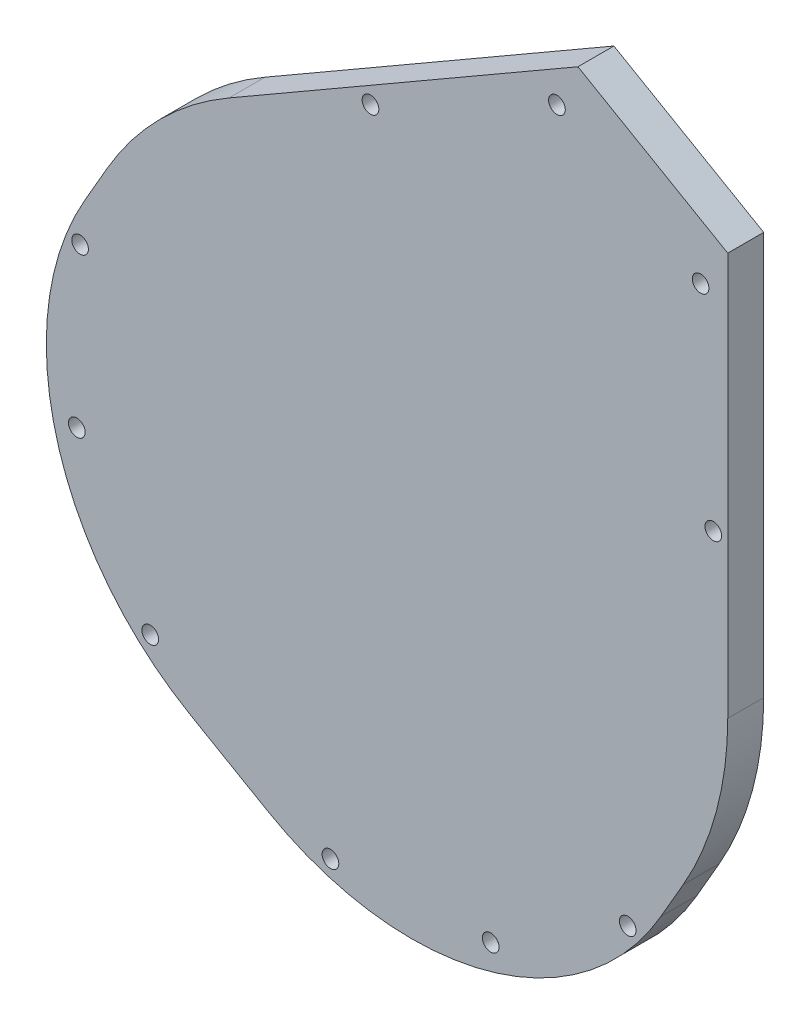
ISO-10303-21;
HEADER;
FILE_DESCRIPTION(('STEP AP214'),'2;1');
FILE_NAME('part.step','',(''),(''),'','','');
FILE_SCHEMA(('AUTOMOTIVE_DESIGN { 1 0 10303 214 1 1 1 1 }'));
ENDSEC;
DATA;
#1=APPLICATION_CONTEXT('core data for automotive mechanical design processes');
#2=APPLICATION_PROTOCOL_DEFINITION('international standard','automotive_design',2000,#1);
#3=PRODUCT_CONTEXT('',#1,'mechanical');
#4=PRODUCT('Part','Part','',(#3));
#5=PRODUCT_RELATED_PRODUCT_CATEGORY('part','',(#4));
#6=PRODUCT_DEFINITION_FORMATION('','',#4);
#7=PRODUCT_DEFINITION_CONTEXT('part definition',#1,'design');
#8=PRODUCT_DEFINITION('design','',#6,#7);
#9=PRODUCT_DEFINITION_SHAPE('','',#8);
#10=(LENGTH_UNIT() NAMED_UNIT(*) SI_UNIT(.MILLI.,.METRE.));
#11=(NAMED_UNIT(*) PLANE_ANGLE_UNIT() SI_UNIT($,.RADIAN.));
#12=(NAMED_UNIT(*) SI_UNIT($,.STERADIAN.) SOLID_ANGLE_UNIT());
#13=UNCERTAINTY_MEASURE_WITH_UNIT(LENGTH_MEASURE(1.E-05),#10,'distance_accuracy_value','');
#14=(GEOMETRIC_REPRESENTATION_CONTEXT(3) GLOBAL_UNCERTAINTY_ASSIGNED_CONTEXT((#13)) GLOBAL_UNIT_ASSIGNED_CONTEXT((#10,
#11,#12)) REPRESENTATION_CONTEXT('',''));
#15=CARTESIAN_POINT('',(0.,0.,0.));
#16=DIRECTION('',(0.,0.,1.));
#17=DIRECTION('',(1.,0.,0.));
#18=AXIS2_PLACEMENT_3D('',#15,#16,#17);
#19=CARTESIAN_POINT('',(0.103482409472565,1.99137052399343,0.));
#20=DIRECTION('',(0.,0.,1.));
#21=DIRECTION('',(1.,0.,0.));
#22=AXIS2_PLACEMENT_3D('',#19,#20,#21);
#23=PLANE('',#22);
#24=CARTESIAN_POINT('',(28.6674802089185,80.7675094713847,0.));
#25=DIRECTION('',(0.,0.,1.));
#26=DIRECTION('',(1.,0.,0.));
#27=AXIS2_PLACEMENT_3D('',#24,#25,#26);
#28=CIRCLE('',#27,1.4732);
#29=CARTESIAN_POINT('',(30.1406802089185,80.7675094713847,0.));
#30=VERTEX_POINT('',#29);
#31=EDGE_CURVE('E236',#30,#30,#28,.T.);
#32=ORIENTED_EDGE('',*,*,#31,.T.);
#33=EDGE_LOOP('',(#32));
#34=FACE_BOUND('',#33,.T.);
#35=CARTESIAN_POINT('',(54.0436210502447,66.1165877256513,0.));
#36=DIRECTION('',(0.,0.,1.));
#37=DIRECTION('',(1.,0.,0.));
#38=AXIS2_PLACEMENT_3D('',#35,#36,#37);
#39=CIRCLE('',#38,1.4732);
#40=CARTESIAN_POINT('',(55.5168210502447,66.1165877256513,0.));
#41=VERTEX_POINT('',#40);
#42=EDGE_CURVE('E242',#41,#41,#39,.T.);
#43=ORIENTED_EDGE('',*,*,#42,.T.);
#44=EDGE_LOOP('',(#43));
#45=FACE_BOUND('',#44,.T.);
#46=CARTESIAN_POINT('',(-4.27211491681913,64.3354611976759,0.));
#47=DIRECTION('',(0.,0.,1.));
#48=DIRECTION('',(1.,0.,0.));
#49=AXIS2_PLACEMENT_3D('',#46,#47,#48);
#50=CIRCLE('',#49,1.4732);
#51=CARTESIAN_POINT('',(-2.79891491681913,64.3354611976759,0.));
#52=VERTEX_POINT('',#51);
#53=EDGE_CURVE('E248',#52,#52,#50,.T.);
#54=ORIENTED_EDGE('',*,*,#53,.T.);
#55=EDGE_LOOP('',(#54));
#56=FACE_BOUND('',#55,.T.);
#57=CARTESIAN_POINT('',(-55.5710270998462,17.2749185589491,0.));
#58=DIRECTION('',(0.,0.,1.));
#59=DIRECTION('',(1.,0.,0.));
#60=AXIS2_PLACEMENT_3D('',#57,#58,#59);
#61=CIRCLE('',#60,1.4732);
#62=CARTESIAN_POINT('',(-54.0978270998462,17.2749185589491,0.));
#63=VERTEX_POINT('',#62);
#64=EDGE_CURVE('E254',#63,#63,#61,.T.);
#65=ORIENTED_EDGE('',*,*,#64,.T.);
#66=EDGE_LOOP('',(#65));
#67=FACE_BOUND('',#66,.T.);
#68=CARTESIAN_POINT('',(-56.1468961494133,-11.0137346898085,0.));
#69=DIRECTION('',(0.,0.,1.));
#70=DIRECTION('',(1.,0.,0.));
#71=AXIS2_PLACEMENT_3D('',#68,#69,#70);
#72=CIRCLE('',#71,1.4732);
#73=CARTESIAN_POINT('',(-54.6736961494133,-11.0137346898085,0.));
#74=VERTEX_POINT('',#73);
#75=EDGE_CURVE('E260',#74,#74,#72,.T.);
#76=ORIENTED_EDGE('',*,*,#75,.T.);
#77=EDGE_LOOP('',(#76));
#78=FACE_BOUND('',#77,.T.);
#79=CARTESIAN_POINT('',(-43.1786676791821,-36.2171800025993,0.));
#80=DIRECTION('',(0.,0.,1.));
#81=DIRECTION('',(1.,0.,0.));
#82=AXIS2_PLACEMENT_3D('',#79,#80,#81);
#83=CIRCLE('',#82,1.4732);
#84=CARTESIAN_POINT('',(-41.7054676791821,-36.2171800025993,0.));
#85=VERTEX_POINT('',#84);
#86=EDGE_CURVE('E266',#85,#85,#83,.T.);
#87=ORIENTED_EDGE('',*,*,#86,.T.);
#88=EDGE_LOOP('',(#87));
#89=FACE_BOUND('',#88,.T.);
#90=CARTESIAN_POINT('',(-11.3450179440084,-54.59634624649,0.));
#91=DIRECTION('',(0.,0.,1.));
#92=DIRECTION('',(1.,0.,0.));
#93=AXIS2_PLACEMENT_3D('',#90,#91,#92);
#94=CIRCLE('',#93,1.4732);
#95=CARTESIAN_POINT('',(-9.87181794400842,-54.59634624649,0.));
#96=VERTEX_POINT('',#95);
#97=EDGE_CURVE('E272',#96,#96,#94,.T.);
#98=ORIENTED_EDGE('',*,*,#97,.T.);
#99=EDGE_LOOP('',(#98));
#100=FACE_BOUND('',#99,.T.);
#101=CARTESIAN_POINT('',(16.9659201948758,-53.2254388873952,0.));
#102=DIRECTION('',(0.,0.,1.));
#103=DIRECTION('',(1.,0.,0.));
#104=AXIS2_PLACEMENT_3D('',#101,#102,#103);
#105=CIRCLE('',#104,1.4732);
#106=CARTESIAN_POINT('',(18.4391201948758,-53.2254388873952,0.));
#107=VERTEX_POINT('',#106);
#108=EDGE_CURVE('E278',#107,#107,#105,.T.);
#109=ORIENTED_EDGE('',*,*,#108,.T.);
#110=EDGE_LOOP('',(#109));
#111=FACE_BOUND('',#110,.T.);
#112=CARTESIAN_POINT('',(41.1766780223654,-38.582395036838,0.));
#113=DIRECTION('',(0.,0.,1.));
#114=DIRECTION('',(1.,0.,0.));
#115=AXIS2_PLACEMENT_3D('',#112,#113,#114);
#116=CIRCLE('',#115,1.4732);
#117=CARTESIAN_POINT('',(42.6498780223654,-38.582395036838,0.));
#118=VERTEX_POINT('',#117);
#119=EDGE_CURVE('E284',#118,#118,#116,.T.);
#120=ORIENTED_EDGE('',*,*,#119,.T.);
#121=EDGE_LOOP('',(#120));
#122=FACE_BOUND('',#121,.T.);
#123=CARTESIAN_POINT('',(56.2828473718697,29.374037419534,0.));
#124=DIRECTION('',(0.,0.,1.));
#125=DIRECTION('',(1.,0.,0.));
#126=AXIS2_PLACEMENT_3D('',#123,#124,#125);
#127=CIRCLE('',#126,1.4732);
#128=CARTESIAN_POINT('',(57.7560473718697,29.374037419534,0.));
#129=VERTEX_POINT('',#128);
#130=EDGE_CURVE('E290',#129,#129,#127,.T.);
#131=ORIENTED_EDGE('',*,*,#130,.T.);
#132=EDGE_LOOP('',(#131));
#133=FACE_BOUND('',#132,.T.);
#134=DIRECTION('',(0.86602540378444,-0.499999999999998,0.));
#135=VECTOR('',#134,1.);
#136=CARTESIAN_POINT('',(-80.1334347453141,-19.508046630794,0.));
#137=LINE('',#136,#135);
#138=CARTESIAN_POINT('',(-36.1393442330646,-44.9080466307939,0.));
#139=VERTEX_POINT('',#138);
#140=CARTESIAN_POINT('',(-22.3911909479873,-52.8455466307935,0.));
#141=VERTEX_POINT('',#140);
#142=EDGE_CURVE('E321',#139,#141,#137,.T.);
#143=ORIENTED_EDGE('',*,*,#142,.F.);
#144=CARTESIAN_POINT('',(-10.7393442330648,-0.913956118544348,0.));
#145=DIRECTION('',(0.,0.,1.));
#146=DIRECTION('',(1.,0.,0.));
#147=AXIS2_PLACEMENT_3D('',#144,#145,#146);
#148=CIRCLE('',#147,50.8);
#149=CARTESIAN_POINT('',(-54.7334347453143,24.4860438814555,0.));
#150=VERTEX_POINT('',#149);
#151=EDGE_CURVE('E353',#139,#150,#148,.F.);
#152=ORIENTED_EDGE('',*,*,#151,.T.);
#153=DIRECTION('',(-0.499999999999997,-0.86602540378444,0.));
#154=VECTOR('',#153,1.);
#155=CARTESIAN_POINT('',(-80.1334347453141,-19.508046630794,0.));
#156=LINE('',#155,#154);
#157=CARTESIAN_POINT('',(-50.7646847453143,31.3601205239945,0.));
#158=VERTEX_POINT('',#157);
#159=EDGE_CURVE('E319',#158,#150,#156,.T.);
#160=ORIENTED_EDGE('',*,*,#159,.F.);
#161=CARTESIAN_POINT('',(0.103482409472565,1.99137052399343,0.));
#162=DIRECTION('',(0.,0.,1.));
#163=DIRECTION('',(-1.,0.,0.));
#164=AXIS2_PLACEMENT_3D('',#161,#162,#163);
#165=CIRCLE('',#164,58.7374999999992);
#166=CARTESIAN_POINT('',(-29.2652675905272,52.8595376787811,0.));
#167=VERTEX_POINT('',#166);
#168=EDGE_CURVE('E317',#167,#158,#165,.T.);
#169=ORIENTED_EDGE('',*,*,#168,.F.);
#170=DIRECTION('',(-0.866025403784443,-0.499999999999992,0.));
#171=VECTOR('',#170,1.);
#172=CARTESIAN_POINT('',(32.3771517353856,88.4488050700959,0.));
#173=LINE('',#172,#171);
#174=CARTESIAN_POINT('',(32.3771517353856,88.4488050700959,0.));
#175=VERTEX_POINT('',#174);
#176=EDGE_CURVE('E315',#175,#167,#173,.T.);
#177=ORIENTED_EDGE('',*,*,#176,.F.);
#178=DIRECTION('',(-0.86602540378444,0.499999999999998,0.));
#179=VECTOR('',#178,1.);
#180=CARTESIAN_POINT('',(32.3771517353856,88.4488050700959,0.));
#181=LINE('',#180,#179);
#182=CARTESIAN_POINT('',(58.8409824094726,73.1699053066232,0.));
#183=VERTEX_POINT('',#182);
#184=EDGE_CURVE('E293',#183,#175,#181,.T.);
#185=ORIENTED_EDGE('',*,*,#184,.F.);
#186=DIRECTION('',(0.,1.,0.));
#187=VECTOR('',#186,1.);
#188=CARTESIAN_POINT('',(58.8409824094726,1.99137052399343,0.));
#189=LINE('',#188,#187);
#190=CARTESIAN_POINT('',(58.8409824094726,1.99137052399343,0.));
#191=VERTEX_POINT('',#190);
#192=EDGE_CURVE('E298',#191,#183,#189,.T.);
#193=ORIENTED_EDGE('',*,*,#192,.F.);
#194=CARTESIAN_POINT('',(0.103482409472565,1.99137052399343,0.));
#195=DIRECTION('',(0.,0.,1.));
#196=DIRECTION('',(1.,0.,0.));
#197=AXIS2_PLACEMENT_3D('',#194,#195,#196);
#198=CIRCLE('',#197,58.7375);
#199=CARTESIAN_POINT('',(50.9716495642611,-27.3773794760064,0.));
#200=VERTEX_POINT('',#199);
#201=EDGE_CURVE('E326',#200,#191,#198,.T.);
#202=ORIENTED_EDGE('',*,*,#201,.F.);
#203=DIRECTION('',(0.499999999999998,0.86602540378444,0.));
#204=VECTOR('',#203,1.);
#205=CARTESIAN_POINT('',(21.6028995642622,-78.2455466307933,0.));
#206=LINE('',#205,#204);
#207=CARTESIAN_POINT('',(47.0028995642621,-34.2514561185438,0.));
#208=VERTEX_POINT('',#207);
#209=EDGE_CURVE('E324',#208,#200,#206,.T.);
#210=ORIENTED_EDGE('',*,*,#209,.F.);
#211=CARTESIAN_POINT('',(3.00880905201254,-8.85145611854391,0.));
#212=DIRECTION('',(0.,0.,1.));
#213=DIRECTION('',(1.,0.,0.));
#214=AXIS2_PLACEMENT_3D('',#211,#212,#213);
#215=CIRCLE('',#214,50.8);
#216=EDGE_CURVE('E351',#208,#141,#215,.F.);
#217=ORIENTED_EDGE('',*,*,#216,.T.);
#218=EDGE_LOOP('',(#143,#152,#160,#169,#177,#185,#193,#202,#210,#217));
#219=FACE_BOUND('',#218,.T.);
#220=CARTESIAN_POINT('',(0.103482409472572,1.99137052399344,0.));
#221=DIRECTION('',(0.,0.,1.));
#222=DIRECTION('',(1.,0.,0.));
#223=AXIS2_PLACEMENT_3D('',#220,#221,#222);
#224=CIRCLE('',#223,55.7657000000002);
#225=CARTESIAN_POINT('',(-24.935414966253,51.8197451181732,0.));
#226=VERTEX_POINT('',#225);
#227=CARTESIAN_POINT('',(55.7755693251752,5.22123661107405,0.));
#228=VERTEX_POINT('',#227);
#229=EDGE_CURVE('E180',#226,#228,#224,.T.);
#230=ORIENTED_EDGE('',*,*,#229,.T.);
#231=DIRECTION('',(-0.06053758958794,0.998165918195408,0.));
#232=VECTOR('',#231,1.);
#233=CARTESIAN_POINT('',(55.7755693251752,5.22123661107405,0.));
#234=LINE('',#233,#232);
#235=CARTESIAN_POINT('',(52.1129608347412,65.6116649668911,0.));
#236=VERTEX_POINT('',#235);
#237=EDGE_CURVE('E216',#228,#236,#234,.T.);
#238=ORIENTED_EDGE('',*,*,#237,.T.);
#239=CARTESIAN_POINT('',(36.0840670724291,64.311571246266,0.));
#240=DIRECTION('',(0.,0.,1.));
#241=DIRECTION('',(1.,0.,0.));
#242=AXIS2_PLACEMENT_3D('',#239,#240,#241);
#243=CIRCLE('',#242,16.081532231908);
#244=CARTESIAN_POINT('',(29.1955343806349,78.8430472993028,0.));
#245=VERTEX_POINT('',#244);
#246=EDGE_CURVE('E219',#236,#245,#243,.T.);
#247=ORIENTED_EDGE('',*,*,#246,.T.);
#248=DIRECTION('',(-0.89470583714302,-0.446655868630658,0.));
#249=VECTOR('',#248,1.);
#250=CARTESIAN_POINT('',(29.1955343806349,78.8430472993028,0.));
#251=LINE('',#250,#249);
#252=EDGE_CURVE('E207',#245,#226,#251,.T.);
#253=ORIENTED_EDGE('',*,*,#252,.T.);
#254=EDGE_LOOP('',(#230,#238,#247,#253));
#255=FACE_BOUND('',#254,.T.);
#256=ADVANCED_FACE('F32',(#34,#45,#56,#67,#78,#89,#100,#111,#122,#133,#219,#255),#23,.F.);
#257=CARTESIAN_POINT('',(32.3771517353856,88.4488050700959,6.35));
#258=DIRECTION('',(-0.499999999999998,-0.86602540378444,0.));
#259=DIRECTION('',(0.86602540378444,-0.499999999999998,0.));
#260=AXIS2_PLACEMENT_3D('',#257,#258,#259);
#261=PLANE('',#260);
#262=ORIENTED_EDGE('',*,*,#184,.T.);
#263=DIRECTION('',(0.,0.,-1.));
#264=VECTOR('',#263,1.);
#265=CARTESIAN_POINT('',(32.3771517353856,88.4488050700959,6.35));
#266=LINE('',#265,#264);
#267=CARTESIAN_POINT('',(32.3771517353856,88.4488050700959,6.35));
#268=VERTEX_POINT('',#267);
#269=EDGE_CURVE('E343',#268,#175,#266,.T.);
#270=ORIENTED_EDGE('',*,*,#269,.F.);
#271=DIRECTION('',(-0.86602540378444,0.499999999999998,0.));
#272=VECTOR('',#271,1.);
#273=CARTESIAN_POINT('',(32.3771517353856,88.4488050700959,6.35));
#274=LINE('',#273,#272);
#275=CARTESIAN_POINT('',(58.8409824094726,73.1699053066232,6.35));
#276=VERTEX_POINT('',#275);
#277=EDGE_CURVE('E294',#276,#268,#274,.T.);
#278=ORIENTED_EDGE('',*,*,#277,.F.);
#279=DIRECTION('',(0.,0.,-1.));
#280=VECTOR('',#279,1.);
#281=CARTESIAN_POINT('',(58.8409824094726,73.1699053066232,6.35));
#282=LINE('',#281,#280);
#283=EDGE_CURVE('E312',#276,#183,#282,.T.);
#284=ORIENTED_EDGE('',*,*,#283,.T.);
#285=EDGE_LOOP('',(#262,#270,#278,#284));
#286=FACE_BOUND('',#285,.T.);
#287=ADVANCED_FACE('F383',(#286),#261,.F.);
#288=CARTESIAN_POINT('',(32.3771517353856,88.4488050700959,6.35));
#289=DIRECTION('',(0.499999999999992,-0.866025403784443,0.));
#290=DIRECTION('',(0.866025403784443,0.499999999999992,0.));
#291=AXIS2_PLACEMENT_3D('',#288,#289,#290);
#292=PLANE('',#291);
#293=ORIENTED_EDGE('',*,*,#176,.T.);
#294=DIRECTION('',(0.,0.,-1.));
#295=VECTOR('',#294,1.);
#296=CARTESIAN_POINT('',(-29.2652675905272,52.8595376787811,6.35));
#297=LINE('',#296,#295);
#298=CARTESIAN_POINT('',(-29.2652675905272,52.8595376787811,6.35));
#299=VERTEX_POINT('',#298);
#300=EDGE_CURVE('E340',#299,#167,#297,.T.);
#301=ORIENTED_EDGE('',*,*,#300,.F.);
#302=DIRECTION('',(-0.866025403784443,-0.499999999999992,0.));
#303=VECTOR('',#302,1.);
#304=CARTESIAN_POINT('',(32.3771517353856,88.4488050700959,6.35));
#305=LINE('',#304,#303);
#306=EDGE_CURVE('E297',#268,#299,#305,.T.);
#307=ORIENTED_EDGE('',*,*,#306,.F.);
#308=ORIENTED_EDGE('',*,*,#269,.T.);
#309=EDGE_LOOP('',(#293,#301,#307,#308));
#310=FACE_BOUND('',#309,.T.);
#311=ADVANCED_FACE('F380',(#310),#292,.F.);
#312=CARTESIAN_POINT('',(0.103482409472565,1.99137052399343,6.35));
#313=DIRECTION('',(0.,0.,-1.));
#314=DIRECTION('',(-1.,0.,0.));
#315=AXIS2_PLACEMENT_3D('',#312,#313,#314);
#316=CYLINDRICAL_SURFACE('',#315,58.7374999999992);
#317=ORIENTED_EDGE('',*,*,#168,.T.);
#318=DIRECTION('',(0.,0.,-1.));
#319=VECTOR('',#318,1.);
#320=CARTESIAN_POINT('',(-50.7646847453143,31.3601205239945,6.35));
#321=LINE('',#320,#319);
#322=CARTESIAN_POINT('',(-50.7646847453143,31.3601205239945,6.35));
#323=VERTEX_POINT('',#322);
#324=EDGE_CURVE('E337',#323,#158,#321,.T.);
#325=ORIENTED_EDGE('',*,*,#324,.F.);
#326=CARTESIAN_POINT('',(0.103482409472565,1.99137052399343,6.35));
#327=DIRECTION('',(0.,0.,1.));
#328=DIRECTION('',(-1.,0.,0.));
#329=AXIS2_PLACEMENT_3D('',#326,#327,#328);
#330=CIRCLE('',#329,58.7374999999992);
#331=EDGE_CURVE('E300',#299,#323,#330,.T.);
#332=ORIENTED_EDGE('',*,*,#331,.F.);
#333=ORIENTED_EDGE('',*,*,#300,.T.);
#334=EDGE_LOOP('',(#317,#325,#332,#333));
#335=FACE_BOUND('',#334,.T.);
#336=ADVANCED_FACE('F374',(#335),#316,.T.);
#337=CARTESIAN_POINT('',(-80.1334347453141,-19.508046630794,6.35));
#338=DIRECTION('',(0.86602540378444,-0.499999999999997,0.));
#339=DIRECTION('',(0.499999999999997,0.86602540378444,0.));
#340=AXIS2_PLACEMENT_3D('',#337,#338,#339);
#341=PLANE('',#340);
#342=ORIENTED_EDGE('',*,*,#159,.T.);
#343=DIRECTION('',(0.,0.,-1.));
#344=VECTOR('',#343,1.);
#345=CARTESIAN_POINT('',(-54.7334347453143,24.4860438814555,6.35));
#346=LINE('',#345,#344);
#347=CARTESIAN_POINT('',(-54.7334347453143,24.4860438814555,6.35));
#348=VERTEX_POINT('',#347);
#349=EDGE_CURVE('E55',#150,#348,#346,.F.);
#350=ORIENTED_EDGE('',*,*,#349,.T.);
#351=DIRECTION('',(-0.499999999999997,-0.86602540378444,0.));
#352=VECTOR('',#351,1.);
#353=CARTESIAN_POINT('',(-80.1334347453141,-19.508046630794,6.35));
#354=LINE('',#353,#352);
#355=EDGE_CURVE('E302',#323,#348,#354,.T.);
#356=ORIENTED_EDGE('',*,*,#355,.F.);
#357=ORIENTED_EDGE('',*,*,#324,.T.);
#358=EDGE_LOOP('',(#342,#350,#356,#357));
#359=FACE_BOUND('',#358,.T.);
#360=ADVANCED_FACE('F370',(#359),#341,.F.);
#361=CARTESIAN_POINT('',(-80.1334347453141,-19.508046630794,6.35));
#362=DIRECTION('',(0.499999999999998,0.86602540378444,0.));
#363=DIRECTION('',(-0.86602540378444,0.499999999999998,0.));
#364=AXIS2_PLACEMENT_3D('',#361,#362,#363);
#365=PLANE('',#364);
#366=DIRECTION('',(0.86602540378444,-0.499999999999998,0.));
#367=VECTOR('',#366,1.);
#368=CARTESIAN_POINT('',(-80.1334347453141,-19.508046630794,6.35));
#369=LINE('',#368,#367);
#370=CARTESIAN_POINT('',(-36.1393442330646,-44.9080466307939,6.35));
#371=VERTEX_POINT('',#370);
#372=CARTESIAN_POINT('',(-22.3911909479873,-52.8455466307935,6.35));
#373=VERTEX_POINT('',#372);
#374=EDGE_CURVE('E304',#371,#373,#369,.T.);
#375=ORIENTED_EDGE('',*,*,#374,.F.);
#376=DIRECTION('',(0.,0.,-1.));
#377=VECTOR('',#376,1.);
#378=CARTESIAN_POINT('',(-36.1393442330646,-44.9080466307939,6.35));
#379=LINE('',#378,#377);
#380=EDGE_CURVE('E348',#371,#139,#379,.T.);
#381=ORIENTED_EDGE('',*,*,#380,.T.);
#382=ORIENTED_EDGE('',*,*,#142,.T.);
#383=DIRECTION('',(0.,0.,-1.));
#384=VECTOR('',#383,1.);
#385=CARTESIAN_POINT('',(-22.3911909479873,-52.8455466307935,6.35));
#386=LINE('',#385,#384);
#387=EDGE_CURVE('E346',#141,#373,#386,.F.);
#388=ORIENTED_EDGE('',*,*,#387,.T.);
#389=EDGE_LOOP('',(#375,#381,#382,#388));
#390=FACE_BOUND('',#389,.T.);
#391=ADVANCED_FACE('F362',(#390),#365,.F.);
#392=CARTESIAN_POINT('',(21.6028995642622,-78.2455466307933,6.35));
#393=DIRECTION('',(-0.86602540378444,0.499999999999998,0.));
#394=DIRECTION('',(-0.499999999999998,-0.86602540378444,0.));
#395=AXIS2_PLACEMENT_3D('',#392,#393,#394);
#396=PLANE('',#395);
#397=DIRECTION('',(0.499999999999998,0.86602540378444,0.));
#398=VECTOR('',#397,1.);
#399=CARTESIAN_POINT('',(21.6028995642622,-78.2455466307933,6.35));
#400=LINE('',#399,#398);
#401=CARTESIAN_POINT('',(47.0028995642621,-34.2514561185438,6.35));
#402=VERTEX_POINT('',#401);
#403=CARTESIAN_POINT('',(50.9716495642611,-27.3773794760064,6.35));
#404=VERTEX_POINT('',#403);
#405=EDGE_CURVE('E306',#402,#404,#400,.T.);
#406=ORIENTED_EDGE('',*,*,#405,.F.);
#407=DIRECTION('',(0.,0.,-1.));
#408=VECTOR('',#407,1.);
#409=CARTESIAN_POINT('',(47.0028995642621,-34.2514561185438,6.35));
#410=LINE('',#409,#408);
#411=EDGE_CURVE('E11',#402,#208,#410,.T.);
#412=ORIENTED_EDGE('',*,*,#411,.T.);
#413=ORIENTED_EDGE('',*,*,#209,.T.);
#414=DIRECTION('',(0.,0.,-1.));
#415=VECTOR('',#414,1.);
#416=CARTESIAN_POINT('',(50.9716495642611,-27.3773794760064,6.35));
#417=LINE('',#416,#415);
#418=EDGE_CURVE('E334',#404,#200,#417,.T.);
#419=ORIENTED_EDGE('',*,*,#418,.F.);
#420=EDGE_LOOP('',(#406,#412,#413,#419));
#421=FACE_BOUND('',#420,.T.);
#422=ADVANCED_FACE('F396',(#421),#396,.F.);
#423=CARTESIAN_POINT('',(0.103482409472565,1.99137052399343,6.35));
#424=DIRECTION('',(0.,0.,-1.));
#425=DIRECTION('',(-1.,0.,0.));
#426=AXIS2_PLACEMENT_3D('',#423,#424,#425);
#427=CYLINDRICAL_SURFACE('',#426,58.7375);
#428=ORIENTED_EDGE('',*,*,#201,.T.);
#429=DIRECTION('',(0.,0.,-1.));
#430=VECTOR('',#429,1.);
#431=CARTESIAN_POINT('',(58.8409824094726,1.99137052399343,6.35));
#432=LINE('',#431,#430);
#433=CARTESIAN_POINT('',(58.8409824094726,1.99137052399343,6.35));
#434=VERTEX_POINT('',#433);
#435=EDGE_CURVE('E331',#434,#191,#432,.T.);
#436=ORIENTED_EDGE('',*,*,#435,.F.);
#437=CARTESIAN_POINT('',(0.103482409472565,1.99137052399343,6.35));
#438=DIRECTION('',(0.,0.,1.));
#439=DIRECTION('',(1.,0.,0.));
#440=AXIS2_PLACEMENT_3D('',#437,#438,#439);
#441=CIRCLE('',#440,58.7375);
#442=EDGE_CURVE('E308',#404,#434,#441,.T.);
#443=ORIENTED_EDGE('',*,*,#442,.F.);
#444=ORIENTED_EDGE('',*,*,#418,.T.);
#445=EDGE_LOOP('',(#428,#436,#443,#444));
#446=FACE_BOUND('',#445,.T.);
#447=ADVANCED_FACE('F392',(#446),#427,.T.);
#448=CARTESIAN_POINT('',(58.8409824094726,1.99137052399343,6.35));
#449=DIRECTION('',(-1.,0.,0.));
#450=DIRECTION('',(0.,0.,1.));
#451=AXIS2_PLACEMENT_3D('',#448,#449,#450);
#452=PLANE('',#451);
#453=ORIENTED_EDGE('',*,*,#192,.T.);
#454=ORIENTED_EDGE('',*,*,#283,.F.);
#455=DIRECTION('',(0.,1.,0.));
#456=VECTOR('',#455,1.);
#457=CARTESIAN_POINT('',(58.8409824094726,1.99137052399343,6.35));
#458=LINE('',#457,#456);
#459=EDGE_CURVE('E310',#434,#276,#458,.T.);
#460=ORIENTED_EDGE('',*,*,#459,.F.);
#461=ORIENTED_EDGE('',*,*,#435,.T.);
#462=EDGE_LOOP('',(#453,#454,#460,#461));
#463=FACE_BOUND('',#462,.T.);
#464=ADVANCED_FACE('F387',(#463),#452,.F.);
#465=CARTESIAN_POINT('',(0.103482409472565,1.99137052399343,6.35));
#466=DIRECTION('',(0.,0.,1.));
#467=DIRECTION('',(1.,0.,0.));
#468=AXIS2_PLACEMENT_3D('',#465,#466,#467);
#469=PLANE('',#468);
#470=CARTESIAN_POINT('',(28.6674802089185,80.7675094713847,6.35));
#471=DIRECTION('',(0.,0.,1.));
#472=DIRECTION('',(1.,0.,0.));
#473=AXIS2_PLACEMENT_3D('',#470,#471,#472);
#474=CIRCLE('',#473,1.47319999999999);
#475=CARTESIAN_POINT('',(30.1406802089185,80.7675094713847,6.35));
#476=VERTEX_POINT('',#475);
#477=EDGE_CURVE('E233',#476,#476,#474,.T.);
#478=ORIENTED_EDGE('',*,*,#477,.F.);
#479=EDGE_LOOP('',(#478));
#480=FACE_BOUND('',#479,.T.);
#481=CARTESIAN_POINT('',(54.0436210502447,66.1165877256513,6.35));
#482=DIRECTION('',(0.,0.,1.));
#483=DIRECTION('',(1.,0.,0.));
#484=AXIS2_PLACEMENT_3D('',#481,#482,#483);
#485=CIRCLE('',#484,1.47319999999999);
#486=CARTESIAN_POINT('',(55.5168210502447,66.1165877256513,6.35));
#487=VERTEX_POINT('',#486);
#488=EDGE_CURVE('E239',#487,#487,#485,.T.);
#489=ORIENTED_EDGE('',*,*,#488,.F.);
#490=EDGE_LOOP('',(#489));
#491=FACE_BOUND('',#490,.T.);
#492=CARTESIAN_POINT('',(-4.27211491681913,64.3354611976759,6.35));
#493=DIRECTION('',(0.,0.,1.));
#494=DIRECTION('',(1.,0.,0.));
#495=AXIS2_PLACEMENT_3D('',#492,#493,#494);
#496=CIRCLE('',#495,1.47319999999999);
#497=CARTESIAN_POINT('',(-2.79891491681914,64.3354611976759,6.35));
#498=VERTEX_POINT('',#497);
#499=EDGE_CURVE('E245',#498,#498,#496,.T.);
#500=ORIENTED_EDGE('',*,*,#499,.F.);
#501=EDGE_LOOP('',(#500));
#502=FACE_BOUND('',#501,.T.);
#503=CARTESIAN_POINT('',(-55.5710270998462,17.2749185589491,6.35));
#504=DIRECTION('',(0.,0.,1.));
#505=DIRECTION('',(1.,0.,0.));
#506=AXIS2_PLACEMENT_3D('',#503,#504,#505);
#507=CIRCLE('',#506,1.47319999999999);
#508=CARTESIAN_POINT('',(-54.0978270998462,17.2749185589491,6.35));
#509=VERTEX_POINT('',#508);
#510=EDGE_CURVE('E251',#509,#509,#507,.T.);
#511=ORIENTED_EDGE('',*,*,#510,.F.);
#512=EDGE_LOOP('',(#511));
#513=FACE_BOUND('',#512,.T.);
#514=CARTESIAN_POINT('',(-56.1468961494133,-11.0137346898085,6.35));
#515=DIRECTION('',(0.,0.,1.));
#516=DIRECTION('',(1.,0.,0.));
#517=AXIS2_PLACEMENT_3D('',#514,#515,#516);
#518=CIRCLE('',#517,1.47319999999999);
#519=CARTESIAN_POINT('',(-54.6736961494133,-11.0137346898085,6.35));
#520=VERTEX_POINT('',#519);
#521=EDGE_CURVE('E257',#520,#520,#518,.T.);
#522=ORIENTED_EDGE('',*,*,#521,.F.);
#523=EDGE_LOOP('',(#522));
#524=FACE_BOUND('',#523,.T.);
#525=CARTESIAN_POINT('',(-43.1786676791821,-36.2171800025993,6.35));
#526=DIRECTION('',(0.,0.,1.));
#527=DIRECTION('',(1.,0.,0.));
#528=AXIS2_PLACEMENT_3D('',#525,#526,#527);
#529=CIRCLE('',#528,1.47319999999999);
#530=CARTESIAN_POINT('',(-41.7054676791821,-36.2171800025993,6.35));
#531=VERTEX_POINT('',#530);
#532=EDGE_CURVE('E263',#531,#531,#529,.T.);
#533=ORIENTED_EDGE('',*,*,#532,.F.);
#534=EDGE_LOOP('',(#533));
#535=FACE_BOUND('',#534,.T.);
#536=CARTESIAN_POINT('',(-11.3450179440084,-54.59634624649,6.35));
#537=DIRECTION('',(0.,0.,1.));
#538=DIRECTION('',(1.,0.,0.));
#539=AXIS2_PLACEMENT_3D('',#536,#537,#538);
#540=CIRCLE('',#539,1.47319999999999);
#541=CARTESIAN_POINT('',(-9.87181794400844,-54.59634624649,6.35));
#542=VERTEX_POINT('',#541);
#543=EDGE_CURVE('E269',#542,#542,#540,.T.);
#544=ORIENTED_EDGE('',*,*,#543,.F.);
#545=EDGE_LOOP('',(#544));
#546=FACE_BOUND('',#545,.T.);
#547=CARTESIAN_POINT('',(16.9659201948758,-53.2254388873952,6.35));
#548=DIRECTION('',(0.,0.,1.));
#549=DIRECTION('',(1.,0.,0.));
#550=AXIS2_PLACEMENT_3D('',#547,#548,#549);
#551=CIRCLE('',#550,1.47319999999999);
#552=CARTESIAN_POINT('',(18.4391201948758,-53.2254388873952,6.35));
#553=VERTEX_POINT('',#552);
#554=EDGE_CURVE('E275',#553,#553,#551,.T.);
#555=ORIENTED_EDGE('',*,*,#554,.F.);
#556=EDGE_LOOP('',(#555));
#557=FACE_BOUND('',#556,.T.);
#558=CARTESIAN_POINT('',(41.1766780223654,-38.582395036838,6.35));
#559=DIRECTION('',(0.,0.,1.));
#560=DIRECTION('',(1.,0.,0.));
#561=AXIS2_PLACEMENT_3D('',#558,#559,#560);
#562=CIRCLE('',#561,1.47319999999999);
#563=CARTESIAN_POINT('',(42.6498780223654,-38.582395036838,6.35));
#564=VERTEX_POINT('',#563);
#565=EDGE_CURVE('E281',#564,#564,#562,.T.);
#566=ORIENTED_EDGE('',*,*,#565,.F.);
#567=EDGE_LOOP('',(#566));
#568=FACE_BOUND('',#567,.T.);
#569=CARTESIAN_POINT('',(56.2828473718697,29.374037419534,6.35));
#570=DIRECTION('',(0.,0.,1.));
#571=DIRECTION('',(1.,0.,0.));
#572=AXIS2_PLACEMENT_3D('',#569,#570,#571);
#573=CIRCLE('',#572,1.47319999999999);
#574=CARTESIAN_POINT('',(57.7560473718697,29.374037419534,6.35));
#575=VERTEX_POINT('',#574);
#576=EDGE_CURVE('E287',#575,#575,#573,.T.);
#577=ORIENTED_EDGE('',*,*,#576,.F.);
#578=EDGE_LOOP('',(#577));
#579=FACE_BOUND('',#578,.T.);
#580=ORIENTED_EDGE('',*,*,#355,.T.);
#581=CARTESIAN_POINT('',(-10.7393442330648,-0.913956118544348,6.35));
#582=DIRECTION('',(0.,0.,1.));
#583=DIRECTION('',(1.,0.,0.));
#584=AXIS2_PLACEMENT_3D('',#581,#582,#583);
#585=CIRCLE('',#584,50.8);
#586=EDGE_CURVE('E40',#348,#371,#585,.T.);
#587=ORIENTED_EDGE('',*,*,#586,.T.);
#588=ORIENTED_EDGE('',*,*,#374,.T.);
#589=CARTESIAN_POINT('',(3.00880905201254,-8.85145611854391,6.35));
#590=DIRECTION('',(0.,0.,1.));
#591=DIRECTION('',(1.,0.,0.));
#592=AXIS2_PLACEMENT_3D('',#589,#590,#591);
#593=CIRCLE('',#592,50.8);
#594=EDGE_CURVE('E47',#373,#402,#593,.T.);
#595=ORIENTED_EDGE('',*,*,#594,.T.);
#596=ORIENTED_EDGE('',*,*,#405,.T.);
#597=ORIENTED_EDGE('',*,*,#442,.T.);
#598=ORIENTED_EDGE('',*,*,#459,.T.);
#599=ORIENTED_EDGE('',*,*,#277,.T.);
#600=ORIENTED_EDGE('',*,*,#306,.T.);
#601=ORIENTED_EDGE('',*,*,#331,.T.);
#602=EDGE_LOOP('',(#580,#587,#588,#595,#596,#597,#598,#599,#600,#601));
#603=FACE_BOUND('',#602,.T.);
#604=ADVANCED_FACE('F358',(#480,#491,#502,#513,#524,#535,#546,#557,#568,#579,#603),#469,.T.);
#605=CARTESIAN_POINT('',(56.2828473718697,29.374037419534,6.35));
#606=DIRECTION('',(0.,0.,1.));
#607=DIRECTION('',(1.,0.,0.));
#608=AXIS2_PLACEMENT_3D('',#605,#606,#607);
#609=CYLINDRICAL_SURFACE('',#608,1.47319999999999);
#610=ORIENTED_EDGE('',*,*,#130,.F.);
#611=EDGE_LOOP('',(#610));
#612=FACE_BOUND('',#611,.T.);
#613=ORIENTED_EDGE('',*,*,#576,.T.);
#614=EDGE_LOOP('',(#613));
#615=FACE_BOUND('',#614,.T.);
#616=ADVANCED_FACE('F489',(#612,#615),#609,.F.);
#617=CARTESIAN_POINT('',(41.1766780223654,-38.582395036838,6.35));
#618=DIRECTION('',(0.,0.,1.));
#619=DIRECTION('',(1.,0.,0.));
#620=AXIS2_PLACEMENT_3D('',#617,#618,#619);
#621=CYLINDRICAL_SURFACE('',#620,1.47319999999999);
#622=ORIENTED_EDGE('',*,*,#119,.F.);
#623=EDGE_LOOP('',(#622));
#624=FACE_BOUND('',#623,.T.);
#625=ORIENTED_EDGE('',*,*,#565,.T.);
#626=EDGE_LOOP('',(#625));
#627=FACE_BOUND('',#626,.T.);
#628=ADVANCED_FACE('F485',(#624,#627),#621,.F.);
#629=CARTESIAN_POINT('',(16.9659201948758,-53.2254388873952,6.35));
#630=DIRECTION('',(0.,0.,1.));
#631=DIRECTION('',(1.,0.,0.));
#632=AXIS2_PLACEMENT_3D('',#629,#630,#631);
#633=CYLINDRICAL_SURFACE('',#632,1.47319999999999);
#634=ORIENTED_EDGE('',*,*,#108,.F.);
#635=EDGE_LOOP('',(#634));
#636=FACE_BOUND('',#635,.T.);
#637=ORIENTED_EDGE('',*,*,#554,.T.);
#638=EDGE_LOOP('',(#637));
#639=FACE_BOUND('',#638,.T.);
#640=ADVANCED_FACE('F481',(#636,#639),#633,.F.);
#641=CARTESIAN_POINT('',(-11.3450179440084,-54.59634624649,6.35));
#642=DIRECTION('',(0.,0.,1.));
#643=DIRECTION('',(1.,0.,0.));
#644=AXIS2_PLACEMENT_3D('',#641,#642,#643);
#645=CYLINDRICAL_SURFACE('',#644,1.47319999999999);
#646=ORIENTED_EDGE('',*,*,#97,.F.);
#647=EDGE_LOOP('',(#646));
#648=FACE_BOUND('',#647,.T.);
#649=ORIENTED_EDGE('',*,*,#543,.T.);
#650=EDGE_LOOP('',(#649));
#651=FACE_BOUND('',#650,.T.);
#652=ADVANCED_FACE('F477',(#648,#651),#645,.F.);
#653=CARTESIAN_POINT('',(-43.1786676791821,-36.2171800025993,6.35));
#654=DIRECTION('',(0.,0.,1.));
#655=DIRECTION('',(1.,0.,0.));
#656=AXIS2_PLACEMENT_3D('',#653,#654,#655);
#657=CYLINDRICAL_SURFACE('',#656,1.47319999999999);
#658=ORIENTED_EDGE('',*,*,#86,.F.);
#659=EDGE_LOOP('',(#658));
#660=FACE_BOUND('',#659,.T.);
#661=ORIENTED_EDGE('',*,*,#532,.T.);
#662=EDGE_LOOP('',(#661));
#663=FACE_BOUND('',#662,.T.);
#664=ADVANCED_FACE('F473',(#660,#663),#657,.F.);
#665=CARTESIAN_POINT('',(-56.1468961494133,-11.0137346898085,6.35));
#666=DIRECTION('',(0.,0.,1.));
#667=DIRECTION('',(1.,0.,0.));
#668=AXIS2_PLACEMENT_3D('',#665,#666,#667);
#669=CYLINDRICAL_SURFACE('',#668,1.47319999999999);
#670=ORIENTED_EDGE('',*,*,#75,.F.);
#671=EDGE_LOOP('',(#670));
#672=FACE_BOUND('',#671,.T.);
#673=ORIENTED_EDGE('',*,*,#521,.T.);
#674=EDGE_LOOP('',(#673));
#675=FACE_BOUND('',#674,.T.);
#676=ADVANCED_FACE('F469',(#672,#675),#669,.F.);
#677=CARTESIAN_POINT('',(-55.5710270998462,17.2749185589491,6.35));
#678=DIRECTION('',(0.,0.,1.));
#679=DIRECTION('',(1.,0.,0.));
#680=AXIS2_PLACEMENT_3D('',#677,#678,#679);
#681=CYLINDRICAL_SURFACE('',#680,1.47319999999999);
#682=ORIENTED_EDGE('',*,*,#64,.F.);
#683=EDGE_LOOP('',(#682));
#684=FACE_BOUND('',#683,.T.);
#685=ORIENTED_EDGE('',*,*,#510,.T.);
#686=EDGE_LOOP('',(#685));
#687=FACE_BOUND('',#686,.T.);
#688=ADVANCED_FACE('F465',(#684,#687),#681,.F.);
#689=CARTESIAN_POINT('',(-4.27211491681913,64.3354611976759,6.35));
#690=DIRECTION('',(0.,0.,1.));
#691=DIRECTION('',(1.,0.,0.));
#692=AXIS2_PLACEMENT_3D('',#689,#690,#691);
#693=CYLINDRICAL_SURFACE('',#692,1.47319999999999);
#694=ORIENTED_EDGE('',*,*,#53,.F.);
#695=EDGE_LOOP('',(#694));
#696=FACE_BOUND('',#695,.T.);
#697=ORIENTED_EDGE('',*,*,#499,.T.);
#698=EDGE_LOOP('',(#697));
#699=FACE_BOUND('',#698,.T.);
#700=ADVANCED_FACE('F461',(#696,#699),#693,.F.);
#701=CARTESIAN_POINT('',(54.0436210502447,66.1165877256513,6.35));
#702=DIRECTION('',(0.,0.,1.));
#703=DIRECTION('',(1.,0.,0.));
#704=AXIS2_PLACEMENT_3D('',#701,#702,#703);
#705=CYLINDRICAL_SURFACE('',#704,1.47319999999999);
#706=ORIENTED_EDGE('',*,*,#42,.F.);
#707=EDGE_LOOP('',(#706));
#708=FACE_BOUND('',#707,.T.);
#709=ORIENTED_EDGE('',*,*,#488,.T.);
#710=EDGE_LOOP('',(#709));
#711=FACE_BOUND('',#710,.T.);
#712=ADVANCED_FACE('F457',(#708,#711),#705,.F.);
#713=CARTESIAN_POINT('',(28.6674802089185,80.7675094713847,6.35));
#714=DIRECTION('',(0.,0.,1.));
#715=DIRECTION('',(1.,0.,0.));
#716=AXIS2_PLACEMENT_3D('',#713,#714,#715);
#717=CYLINDRICAL_SURFACE('',#716,1.47319999999999);
#718=ORIENTED_EDGE('',*,*,#31,.F.);
#719=EDGE_LOOP('',(#718));
#720=FACE_BOUND('',#719,.T.);
#721=ORIENTED_EDGE('',*,*,#477,.T.);
#722=EDGE_LOOP('',(#721));
#723=FACE_BOUND('',#722,.T.);
#724=ADVANCED_FACE('F439',(#720,#723),#717,.F.);
#725=CARTESIAN_POINT('',(0.103482409472572,1.99137052399344,1.3208));
#726=DIRECTION('',(0.,0.,1.));
#727=DIRECTION('',(1.,0.,0.));
#728=AXIS2_PLACEMENT_3D('',#725,#726,#727);
#729=PLANE('',#728);
#730=CARTESIAN_POINT('',(0.103482409472572,1.99137052399344,1.3208));
#731=DIRECTION('',(0.,0.,1.));
#732=DIRECTION('',(1.,0.,0.));
#733=AXIS2_PLACEMENT_3D('',#730,#731,#732);
#734=CIRCLE('',#733,55.7657000000002);
#735=CARTESIAN_POINT('',(-24.935414966253,51.8197451181732,1.3208));
#736=VERTEX_POINT('',#735);
#737=CARTESIAN_POINT('',(55.7755693251752,5.22123661107405,1.3208));
#738=VERTEX_POINT('',#737);
#739=EDGE_CURVE('E203',#736,#738,#734,.T.);
#740=ORIENTED_EDGE('',*,*,#739,.F.);
#741=DIRECTION('',(-0.89470583714302,-0.446655868630658,0.));
#742=VECTOR('',#741,1.);
#743=CARTESIAN_POINT('',(29.1955343806349,78.8430472993028,1.3208));
#744=LINE('',#743,#742);
#745=CARTESIAN_POINT('',(29.1955343806349,78.8430472993028,1.3208));
#746=VERTEX_POINT('',#745);
#747=EDGE_CURVE('E211',#746,#736,#744,.T.);
#748=ORIENTED_EDGE('',*,*,#747,.F.);
#749=CARTESIAN_POINT('',(36.0840670724291,64.311571246266,1.3208));
#750=DIRECTION('',(0.,0.,1.));
#751=DIRECTION('',(1.,0.,0.));
#752=AXIS2_PLACEMENT_3D('',#749,#750,#751);
#753=CIRCLE('',#752,16.081532231908);
#754=CARTESIAN_POINT('',(52.1129608347412,65.6116649668911,1.3208));
#755=VERTEX_POINT('',#754);
#756=EDGE_CURVE('E209',#755,#746,#753,.T.);
#757=ORIENTED_EDGE('',*,*,#756,.F.);
#758=DIRECTION('',(-0.06053758958794,0.998165918195408,0.));
#759=VECTOR('',#758,1.);
#760=CARTESIAN_POINT('',(55.7755693251752,5.22123661107405,1.3208));
#761=LINE('',#760,#759);
#762=EDGE_CURVE('E206',#738,#755,#761,.T.);
#763=ORIENTED_EDGE('',*,*,#762,.F.);
#764=EDGE_LOOP('',(#740,#748,#757,#763));
#765=FACE_BOUND('',#764,.T.);
#766=DIRECTION('',(-0.0605375895879399,0.998165918195408,0.));
#767=VECTOR('',#766,1.);
#768=CARTESIAN_POINT('',(53.5696450118894,5.0903834929791,1.3208));
#769=LINE('',#768,#767);
#770=CARTESIAN_POINT('',(53.5696450118894,5.0903834929791,1.3208));
#771=VERTEX_POINT('',#770);
#772=CARTESIAN_POINT('',(49.9086258187045,65.4546069344816,1.3208));
#773=VERTEX_POINT('',#772);
#774=EDGE_CURVE('E164',#771,#773,#769,.T.);
#775=ORIENTED_EDGE('',*,*,#774,.T.);
#776=CARTESIAN_POINT('',(36.0840670724291,64.311571246266,1.3208));
#777=DIRECTION('',(0.,0.,1.));
#778=DIRECTION('',(1.,0.,0.));
#779=AXIS2_PLACEMENT_3D('',#776,#777,#778);
#780=CIRCLE('',#779,13.871732231908);
#781=CARTESIAN_POINT('',(30.1616856427186,76.8555081607589,1.3208));
#782=VERTEX_POINT('',#781);
#783=EDGE_CURVE('E185',#773,#782,#780,.T.);
#784=ORIENTED_EDGE('',*,*,#783,.T.);
#785=DIRECTION('',(-0.89470583714302,-0.446655868630657,0.));
#786=VECTOR('',#785,1.);
#787=CARTESIAN_POINT('',(30.1616856427186,76.8555081607589,1.3208));
#788=LINE('',#787,#786);
#789=CARTESIAN_POINT('',(-23.9457749340472,49.8439320649933,1.3208));
#790=VERTEX_POINT('',#789);
#791=EDGE_CURVE('E167',#782,#790,#788,.T.);
#792=ORIENTED_EDGE('',*,*,#791,.T.);
#793=CARTESIAN_POINT('',(0.103482409472572,1.99137052399344,1.3208));
#794=DIRECTION('',(0.,0.,1.));
#795=DIRECTION('',(1.,0.,0.));
#796=AXIS2_PLACEMENT_3D('',#793,#794,#795);
#797=CIRCLE('',#796,53.5559000000002);
#798=EDGE_CURVE('E159',#790,#771,#797,.T.);
#799=ORIENTED_EDGE('',*,*,#798,.T.);
#800=EDGE_LOOP('',(#775,#784,#792,#799));
#801=FACE_BOUND('',#800,.T.);
#802=ADVANCED_FACE('F161',(#765,#801),#729,.F.);
#803=CARTESIAN_POINT('',(0.103482409472572,1.99137052399344,1.3208));
#804=DIRECTION('',(0.,0.,-1.));
#805=DIRECTION('',(-1.,0.,0.));
#806=AXIS2_PLACEMENT_3D('',#803,#804,#805);
#807=CYLINDRICAL_SURFACE('',#806,55.7657000000002);
#808=ORIENTED_EDGE('',*,*,#229,.F.);
#809=DIRECTION('',(0.,0.,-1.));
#810=VECTOR('',#809,1.);
#811=CARTESIAN_POINT('',(-24.935414966253,51.8197451181732,1.3208));
#812=LINE('',#811,#810);
#813=EDGE_CURVE('E213',#736,#226,#812,.T.);
#814=ORIENTED_EDGE('',*,*,#813,.F.);
#815=ORIENTED_EDGE('',*,*,#739,.T.);
#816=DIRECTION('',(0.,0.,-1.));
#817=VECTOR('',#816,1.);
#818=CARTESIAN_POINT('',(55.7755693251752,5.22123661107405,1.3208));
#819=LINE('',#818,#817);
#820=EDGE_CURVE('E230',#738,#228,#819,.T.);
#821=ORIENTED_EDGE('',*,*,#820,.T.);
#822=EDGE_LOOP('',(#808,#814,#815,#821));
#823=FACE_BOUND('',#822,.T.);
#824=ADVANCED_FACE('F438',(#823),#807,.F.);
#825=CARTESIAN_POINT('',(55.7755693251752,5.22123661107405,1.3208));
#826=DIRECTION('',(-0.998165918195408,-0.06053758958794,0.));
#827=DIRECTION('',(0.06053758958794,-0.998165918195408,0.));
#828=AXIS2_PLACEMENT_3D('',#825,#826,#827);
#829=PLANE('',#828);
#830=ORIENTED_EDGE('',*,*,#237,.F.);
#831=ORIENTED_EDGE('',*,*,#820,.F.);
#832=ORIENTED_EDGE('',*,*,#762,.T.);
#833=DIRECTION('',(0.,0.,-1.));
#834=VECTOR('',#833,1.);
#835=CARTESIAN_POINT('',(52.1129608347412,65.6116649668911,1.3208));
#836=LINE('',#835,#834);
#837=EDGE_CURVE('E228',#755,#236,#836,.T.);
#838=ORIENTED_EDGE('',*,*,#837,.T.);
#839=EDGE_LOOP('',(#830,#831,#832,#838));
#840=FACE_BOUND('',#839,.T.);
#841=ADVANCED_FACE('F447',(#840),#829,.T.);
#842=CARTESIAN_POINT('',(36.0840670724291,64.311571246266,1.3208));
#843=DIRECTION('',(0.,0.,-1.));
#844=DIRECTION('',(-1.,0.,0.));
#845=AXIS2_PLACEMENT_3D('',#842,#843,#844);
#846=CYLINDRICAL_SURFACE('',#845,16.081532231908);
#847=ORIENTED_EDGE('',*,*,#246,.F.);
#848=ORIENTED_EDGE('',*,*,#837,.F.);
#849=ORIENTED_EDGE('',*,*,#756,.T.);
#850=DIRECTION('',(0.,0.,-1.));
#851=VECTOR('',#850,1.);
#852=CARTESIAN_POINT('',(29.1955343806349,78.8430472993028,1.3208));
#853=LINE('',#852,#851);
#854=EDGE_CURVE('E226',#746,#245,#853,.T.);
#855=ORIENTED_EDGE('',*,*,#854,.T.);
#856=EDGE_LOOP('',(#847,#848,#849,#855));
#857=FACE_BOUND('',#856,.T.);
#858=ADVANCED_FACE('F443',(#857),#846,.F.);
#859=CARTESIAN_POINT('',(29.1955343806349,78.8430472993028,1.3208));
#860=DIRECTION('',(0.446655868630658,-0.89470583714302,0.));
#861=DIRECTION('',(0.89470583714302,0.446655868630658,0.));
#862=AXIS2_PLACEMENT_3D('',#859,#860,#861);
#863=PLANE('',#862);
#864=ORIENTED_EDGE('',*,*,#252,.F.);
#865=ORIENTED_EDGE('',*,*,#854,.F.);
#866=ORIENTED_EDGE('',*,*,#747,.T.);
#867=ORIENTED_EDGE('',*,*,#813,.T.);
#868=EDGE_LOOP('',(#864,#865,#866,#867));
#869=FACE_BOUND('',#868,.T.);
#870=ADVANCED_FACE('F435',(#869),#863,.T.);
#871=CARTESIAN_POINT('',(0.103482409472572,1.99137052399344,1.3208));
#872=DIRECTION('',(0.,0.,-1.));
#873=DIRECTION('',(-1.,0.,0.));
#874=AXIS2_PLACEMENT_3D('',#871,#872,#873);
#875=CYLINDRICAL_SURFACE('',#874,53.5559000000002);
#876=CARTESIAN_POINT('',(0.103482409472572,1.99137052399344,0.));
#877=DIRECTION('',(0.,0.,1.));
#878=DIRECTION('',(1.,0.,0.));
#879=AXIS2_PLACEMENT_3D('',#876,#877,#878);
#880=CIRCLE('',#879,53.5559000000002);
#881=CARTESIAN_POINT('',(-23.9457749340472,49.8439320649933,0.));
#882=VERTEX_POINT('',#881);
#883=CARTESIAN_POINT('',(53.5696450118894,5.0903834929791,0.));
#884=VERTEX_POINT('',#883);
#885=EDGE_CURVE('E176',#882,#884,#880,.T.);
#886=ORIENTED_EDGE('',*,*,#885,.T.);
#887=DIRECTION('',(0.,0.,-1.));
#888=VECTOR('',#887,1.);
#889=CARTESIAN_POINT('',(53.5696450118894,5.0903834929791,1.3208));
#890=LINE('',#889,#888);
#891=EDGE_CURVE('E173',#771,#884,#890,.T.);
#892=ORIENTED_EDGE('',*,*,#891,.F.);
#893=ORIENTED_EDGE('',*,*,#798,.F.);
#894=DIRECTION('',(0.,0.,-1.));
#895=VECTOR('',#894,1.);
#896=CARTESIAN_POINT('',(-23.9457749340472,49.8439320649933,1.3208));
#897=LINE('',#896,#895);
#898=EDGE_CURVE('E190',#790,#882,#897,.T.);
#899=ORIENTED_EDGE('',*,*,#898,.T.);
#900=EDGE_LOOP('',(#886,#892,#893,#899));
#901=FACE_BOUND('',#900,.T.);
#902=ADVANCED_FACE('F174',(#901),#875,.T.);
#903=CARTESIAN_POINT('',(53.5696450118894,5.0903834929791,1.3208));
#904=DIRECTION('',(-0.998165918195408,-0.0605375895879399,0.));
#905=DIRECTION('',(0.0605375895879399,-0.998165918195408,0.));
#906=AXIS2_PLACEMENT_3D('',#903,#904,#905);
#907=PLANE('',#906);
#908=DIRECTION('',(-0.0605375895879399,0.998165918195408,0.));
#909=VECTOR('',#908,1.);
#910=CARTESIAN_POINT('',(53.5696450118894,5.0903834929791,0.));
#911=LINE('',#910,#909);
#912=CARTESIAN_POINT('',(49.9086258187045,65.4546069344816,0.));
#913=VERTEX_POINT('',#912);
#914=EDGE_CURVE('E192',#884,#913,#911,.T.);
#915=ORIENTED_EDGE('',*,*,#914,.T.);
#916=DIRECTION('',(0.,0.,-1.));
#917=VECTOR('',#916,1.);
#918=CARTESIAN_POINT('',(49.9086258187045,65.4546069344816,1.3208));
#919=LINE('',#918,#917);
#920=EDGE_CURVE('E181',#773,#913,#919,.T.);
#921=ORIENTED_EDGE('',*,*,#920,.F.);
#922=ORIENTED_EDGE('',*,*,#774,.F.);
#923=ORIENTED_EDGE('',*,*,#891,.T.);
#924=EDGE_LOOP('',(#915,#921,#922,#923));
#925=FACE_BOUND('',#924,.T.);
#926=ADVANCED_FACE('F183',(#925),#907,.F.);
#927=CARTESIAN_POINT('',(36.0840670724291,64.311571246266,1.3208));
#928=DIRECTION('',(0.,0.,-1.));
#929=DIRECTION('',(-1.,0.,0.));
#930=AXIS2_PLACEMENT_3D('',#927,#928,#929);
#931=CYLINDRICAL_SURFACE('',#930,13.871732231908);
#932=CARTESIAN_POINT('',(36.0840670724291,64.311571246266,0.));
#933=DIRECTION('',(0.,0.,1.));
#934=DIRECTION('',(1.,0.,0.));
#935=AXIS2_PLACEMENT_3D('',#932,#933,#934);
#936=CIRCLE('',#935,13.871732231908);
#937=CARTESIAN_POINT('',(30.1616856427186,76.8555081607589,0.));
#938=VERTEX_POINT('',#937);
#939=EDGE_CURVE('E194',#913,#938,#936,.T.);
#940=ORIENTED_EDGE('',*,*,#939,.T.);
#941=DIRECTION('',(0.,0.,-1.));
#942=VECTOR('',#941,1.);
#943=CARTESIAN_POINT('',(30.1616856427186,76.8555081607589,1.3208));
#944=LINE('',#943,#942);
#945=EDGE_CURVE('E199',#782,#938,#944,.T.);
#946=ORIENTED_EDGE('',*,*,#945,.F.);
#947=ORIENTED_EDGE('',*,*,#783,.F.);
#948=ORIENTED_EDGE('',*,*,#920,.T.);
#949=EDGE_LOOP('',(#940,#946,#947,#948));
#950=FACE_BOUND('',#949,.T.);
#951=ADVANCED_FACE('F420',(#950),#931,.T.);
#952=CARTESIAN_POINT('',(30.1616856427186,76.8555081607589,1.3208));
#953=DIRECTION('',(0.446655868630657,-0.89470583714302,0.));
#954=DIRECTION('',(0.89470583714302,0.446655868630657,0.));
#955=AXIS2_PLACEMENT_3D('',#952,#953,#954);
#956=PLANE('',#955);
#957=DIRECTION('',(-0.89470583714302,-0.446655868630657,0.));
#958=VECTOR('',#957,1.);
#959=CARTESIAN_POINT('',(30.1616856427186,76.8555081607589,0.));
#960=LINE('',#959,#958);
#961=EDGE_CURVE('E170',#938,#882,#960,.T.);
#962=ORIENTED_EDGE('',*,*,#961,.T.);
#963=ORIENTED_EDGE('',*,*,#898,.F.);
#964=ORIENTED_EDGE('',*,*,#791,.F.);
#965=ORIENTED_EDGE('',*,*,#945,.T.);
#966=EDGE_LOOP('',(#962,#963,#964,#965));
#967=FACE_BOUND('',#966,.T.);
#968=ADVANCED_FACE('F415',(#967),#956,.F.);
#969=ORIENTED_EDGE('',*,*,#914,.F.);
#970=ORIENTED_EDGE('',*,*,#885,.F.);
#971=ORIENTED_EDGE('',*,*,#961,.F.);
#972=ORIENTED_EDGE('',*,*,#939,.F.);
#973=EDGE_LOOP('',(#969,#970,#971,#972));
#974=FACE_BOUND('',#973,.T.);
#975=ADVANCED_FACE('F403',(#974),#23,.F.);
#976=CARTESIAN_POINT('',(-10.7393442330648,-0.913956118544348,6.35));
#977=DIRECTION('',(0.,0.,-1.));
#978=DIRECTION('',(-1.,0.,0.));
#979=AXIS2_PLACEMENT_3D('',#976,#977,#978);
#980=CYLINDRICAL_SURFACE('',#979,50.8);
#981=ORIENTED_EDGE('',*,*,#586,.F.);
#982=ORIENTED_EDGE('',*,*,#349,.F.);
#983=ORIENTED_EDGE('',*,*,#151,.F.);
#984=ORIENTED_EDGE('',*,*,#380,.F.);
#985=EDGE_LOOP('',(#981,#982,#983,#984));
#986=FACE_BOUND('',#985,.T.);
#987=ADVANCED_FACE('F365',(#986),#980,.T.);
#988=CARTESIAN_POINT('',(3.00880905201254,-8.85145611854391,6.35));
#989=DIRECTION('',(0.,0.,-1.));
#990=DIRECTION('',(-1.,0.,0.));
#991=AXIS2_PLACEMENT_3D('',#988,#989,#990);
#992=CYLINDRICAL_SURFACE('',#991,50.8);
#993=ORIENTED_EDGE('',*,*,#594,.F.);
#994=ORIENTED_EDGE('',*,*,#387,.F.);
#995=ORIENTED_EDGE('',*,*,#216,.F.);
#996=ORIENTED_EDGE('',*,*,#411,.F.);
#997=EDGE_LOOP('',(#993,#994,#995,#996));
#998=FACE_BOUND('',#997,.T.);
#999=ADVANCED_FACE('F34',(#998),#992,.T.);
#1000=CLOSED_SHELL('',(#256,#287,#311,#336,#360,#391,#422,#447,#464,#604,#616,#628,#640,#652,
#664,#676,#688,#700,#712,#724,#802,#824,#841,#858,#870,#902,#926,#951,#968,#975,#987,#999));
#1001=MANIFOLD_SOLID_BREP('B2',#1000);
#1002=ADVANCED_BREP_SHAPE_REPRESENTATION('',(#18,#1001),#14);
#1003=SHAPE_DEFINITION_REPRESENTATION(#9,#1002);
ENDSEC;
END-ISO-10303-21;
